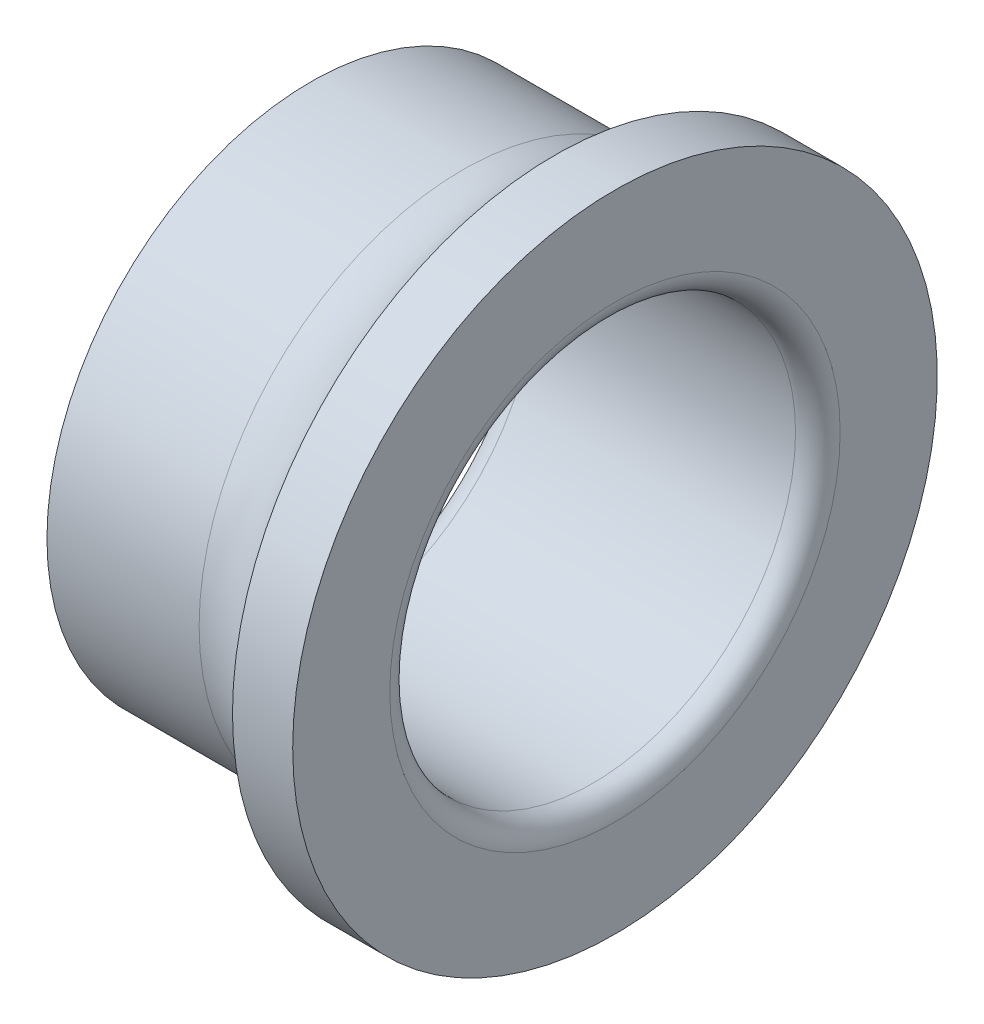
ISO-10303-21;
HEADER;
FILE_DESCRIPTION(('STEP AP214'),'2;1');
FILE_NAME('part.step','',(''),(''),'','','');
FILE_SCHEMA(('AUTOMOTIVE_DESIGN { 1 0 10303 214 1 1 1 1 }'));
ENDSEC;
DATA;
#1=APPLICATION_CONTEXT('core data for automotive mechanical design processes');
#2=APPLICATION_PROTOCOL_DEFINITION('international standard','automotive_design',2000,#1);
#3=PRODUCT_CONTEXT('',#1,'mechanical');
#4=PRODUCT('Part','Part','',(#3));
#5=PRODUCT_RELATED_PRODUCT_CATEGORY('part','',(#4));
#6=PRODUCT_DEFINITION_FORMATION('','',#4);
#7=PRODUCT_DEFINITION_CONTEXT('part definition',#1,'design');
#8=PRODUCT_DEFINITION('design','',#6,#7);
#9=PRODUCT_DEFINITION_SHAPE('','',#8);
#10=(LENGTH_UNIT() NAMED_UNIT(*) SI_UNIT(.MILLI.,.METRE.));
#11=(NAMED_UNIT(*) PLANE_ANGLE_UNIT() SI_UNIT($,.RADIAN.));
#12=(NAMED_UNIT(*) SI_UNIT($,.STERADIAN.) SOLID_ANGLE_UNIT());
#13=UNCERTAINTY_MEASURE_WITH_UNIT(LENGTH_MEASURE(1.E-05),#10,'distance_accuracy_value','');
#14=(GEOMETRIC_REPRESENTATION_CONTEXT(3) GLOBAL_UNCERTAINTY_ASSIGNED_CONTEXT((#13)) GLOBAL_UNIT_ASSIGNED_CONTEXT((#10,
#11,#12)) REPRESENTATION_CONTEXT('',''));
#15=CARTESIAN_POINT('',(0.,0.,0.));
#16=DIRECTION('',(0.,0.,1.));
#17=DIRECTION('',(1.,0.,0.));
#18=AXIS2_PLACEMENT_3D('',#15,#16,#17);
#19=CARTESIAN_POINT('',(13.9,0.,0.));
#20=DIRECTION('',(-1.,0.,0.));
#21=DIRECTION('',(0.,0.,1.));
#22=AXIS2_PLACEMENT_3D('',#19,#20,#21);
#23=TOROIDAL_SURFACE('',#22,11.1,1.1);
#24=CARTESIAN_POINT('',(15.,0.,0.));
#25=DIRECTION('',(-1.,0.,0.));
#26=DIRECTION('',(0.,0.,1.));
#27=AXIS2_PLACEMENT_3D('',#24,#25,#26);
#28=CIRCLE('',#27,11.1);
#29=CARTESIAN_POINT('',(15.,0.,11.1));
#30=VERTEX_POINT('',#29);
#31=EDGE_CURVE('E10',#30,#30,#28,.T.);
#32=ORIENTED_EDGE('',*,*,#31,.F.);
#33=EDGE_LOOP('',(#32));
#34=FACE_BOUND('',#33,.T.);
#35=CARTESIAN_POINT('',(13.9,0.,0.));
#36=DIRECTION('',(-1.,0.,0.));
#37=DIRECTION('',(0.,0.,1.));
#38=AXIS2_PLACEMENT_3D('',#35,#36,#37);
#39=CIRCLE('',#38,10.);
#40=CARTESIAN_POINT('',(13.9,0.,10.));
#41=VERTEX_POINT('',#40);
#42=EDGE_CURVE('E56',#41,#41,#39,.T.);
#43=ORIENTED_EDGE('',*,*,#42,.T.);
#44=EDGE_LOOP('',(#43));
#45=FACE_BOUND('',#44,.T.);
#46=ADVANCED_FACE('F14',(#34,#45),#23,.T.);
#47=CARTESIAN_POINT('',(15.,11.1,0.));
#48=DIRECTION('',(-1.,0.,0.));
#49=DIRECTION('',(0.,0.,1.));
#50=AXIS2_PLACEMENT_3D('',#47,#48,#49);
#51=PLANE('',#50);
#52=CARTESIAN_POINT('',(15.,0.,0.));
#53=DIRECTION('',(-1.,0.,0.));
#54=DIRECTION('',(0.,0.,1.));
#55=AXIS2_PLACEMENT_3D('',#52,#53,#54);
#56=CIRCLE('',#55,15.8869086912965);
#57=CARTESIAN_POINT('',(15.,0.,15.8869086912965));
#58=VERTEX_POINT('',#57);
#59=EDGE_CURVE('E21',#58,#58,#56,.T.);
#60=ORIENTED_EDGE('',*,*,#59,.F.);
#61=EDGE_LOOP('',(#60));
#62=FACE_BOUND('',#61,.T.);
#63=ORIENTED_EDGE('',*,*,#31,.T.);
#64=EDGE_LOOP('',(#63));
#65=FACE_BOUND('',#64,.T.);
#66=ADVANCED_FACE('F95',(#62,#65),#51,.F.);
#67=CARTESIAN_POINT('',(13.9,0.,0.));
#68=DIRECTION('',(-1.,0.,0.));
#69=DIRECTION('',(0.,0.,1.));
#70=AXIS2_PLACEMENT_3D('',#67,#68,#69);
#71=CYLINDRICAL_SURFACE('',#70,15.8869086912965);
#72=CARTESIAN_POINT('',(12.0315389351832,0.,0.));
#73=DIRECTION('',(-1.,0.,0.));
#74=DIRECTION('',(0.,0.,1.));
#75=AXIS2_PLACEMENT_3D('',#72,#73,#74);
#76=CIRCLE('',#75,15.8869086912965);
#77=CARTESIAN_POINT('',(12.0315389351832,0.,15.8869086912965));
#78=VERTEX_POINT('',#77);
#79=EDGE_CURVE('E30',#78,#78,#76,.T.);
#80=ORIENTED_EDGE('',*,*,#79,.F.);
#81=EDGE_LOOP('',(#80));
#82=FACE_BOUND('',#81,.T.);
#83=ORIENTED_EDGE('',*,*,#59,.T.);
#84=EDGE_LOOP('',(#83));
#85=FACE_BOUND('',#84,.T.);
#86=ADVANCED_FACE('F88',(#82,#85),#71,.T.);
#87=CARTESIAN_POINT('',(7.5,0.,0.));
#88=DIRECTION('',(-1.,0.,0.));
#89=DIRECTION('',(0.,0.,1.));
#90=AXIS2_PLACEMENT_3D('',#87,#88,#89);
#91=TOROIDAL_SURFACE('',#90,18.,5.);
#92=ORIENTED_EDGE('',*,*,#79,.T.);
#93=EDGE_LOOP('',(#92));
#94=FACE_BOUND('',#93,.T.);
#95=CARTESIAN_POINT('',(7.5,0.,0.));
#96=DIRECTION('',(-1.,0.,0.));
#97=DIRECTION('',(0.,0.,1.));
#98=AXIS2_PLACEMENT_3D('',#95,#96,#97);
#99=CIRCLE('',#98,13.);
#100=CARTESIAN_POINT('',(7.5,0.,13.));
#101=VERTEX_POINT('',#100);
#102=EDGE_CURVE('E38',#101,#101,#99,.T.);
#103=ORIENTED_EDGE('',*,*,#102,.F.);
#104=EDGE_LOOP('',(#103));
#105=FACE_BOUND('',#104,.T.);
#106=ADVANCED_FACE('F83',(#94,#105),#91,.F.);
#107=CARTESIAN_POINT('',(13.9,0.,0.));
#108=DIRECTION('',(-1.,0.,0.));
#109=DIRECTION('',(0.,0.,1.));
#110=AXIS2_PLACEMENT_3D('',#107,#108,#109);
#111=CYLINDRICAL_SURFACE('',#110,13.);
#112=CARTESIAN_POINT('',(0.,0.,0.));
#113=DIRECTION('',(-1.,0.,0.));
#114=DIRECTION('',(0.,0.,1.));
#115=AXIS2_PLACEMENT_3D('',#112,#113,#114);
#116=CIRCLE('',#115,13.);
#117=CARTESIAN_POINT('',(0.,0.,13.));
#118=VERTEX_POINT('',#117);
#119=EDGE_CURVE('E44',#118,#118,#116,.T.);
#120=ORIENTED_EDGE('',*,*,#119,.F.);
#121=EDGE_LOOP('',(#120));
#122=FACE_BOUND('',#121,.T.);
#123=ORIENTED_EDGE('',*,*,#102,.T.);
#124=EDGE_LOOP('',(#123));
#125=FACE_BOUND('',#124,.T.);
#126=ADVANCED_FACE('F77',(#122,#125),#111,.T.);
#127=CARTESIAN_POINT('',(0.,13.,0.));
#128=DIRECTION('',(1.,0.,0.));
#129=DIRECTION('',(0.,0.,-1.));
#130=AXIS2_PLACEMENT_3D('',#127,#128,#129);
#131=PLANE('',#130);
#132=CARTESIAN_POINT('',(0.,0.,0.));
#133=DIRECTION('',(-1.,0.,0.));
#134=DIRECTION('',(0.,0.,1.));
#135=AXIS2_PLACEMENT_3D('',#132,#133,#134);
#136=CIRCLE('',#135,11.1);
#137=CARTESIAN_POINT('',(0.,0.,11.1));
#138=VERTEX_POINT('',#137);
#139=EDGE_CURVE('E48',#138,#138,#136,.T.);
#140=ORIENTED_EDGE('',*,*,#139,.F.);
#141=EDGE_LOOP('',(#140));
#142=FACE_BOUND('',#141,.T.);
#143=ORIENTED_EDGE('',*,*,#119,.T.);
#144=EDGE_LOOP('',(#143));
#145=FACE_BOUND('',#144,.T.);
#146=ADVANCED_FACE('F71',(#142,#145),#131,.F.);
#147=CARTESIAN_POINT('',(1.1,0.,0.));
#148=DIRECTION('',(-1.,0.,0.));
#149=DIRECTION('',(0.,0.,1.));
#150=AXIS2_PLACEMENT_3D('',#147,#148,#149);
#151=TOROIDAL_SURFACE('',#150,11.1,1.1);
#152=CARTESIAN_POINT('',(1.1,0.,0.));
#153=DIRECTION('',(-1.,0.,0.));
#154=DIRECTION('',(0.,0.,1.));
#155=AXIS2_PLACEMENT_3D('',#152,#153,#154);
#156=CIRCLE('',#155,10.);
#157=CARTESIAN_POINT('',(1.1,0.,10.));
#158=VERTEX_POINT('',#157);
#159=EDGE_CURVE('E52',#158,#158,#156,.T.);
#160=ORIENTED_EDGE('',*,*,#159,.F.);
#161=EDGE_LOOP('',(#160));
#162=FACE_BOUND('',#161,.T.);
#163=ORIENTED_EDGE('',*,*,#139,.T.);
#164=EDGE_LOOP('',(#163));
#165=FACE_BOUND('',#164,.T.);
#166=ADVANCED_FACE('F65',(#162,#165),#151,.T.);
#167=CARTESIAN_POINT('',(13.9,0.,0.));
#168=DIRECTION('',(-1.,0.,0.));
#169=DIRECTION('',(0.,0.,1.));
#170=AXIS2_PLACEMENT_3D('',#167,#168,#169);
#171=CYLINDRICAL_SURFACE('',#170,10.);
#172=ORIENTED_EDGE('',*,*,#42,.F.);
#173=EDGE_LOOP('',(#172));
#174=FACE_BOUND('',#173,.T.);
#175=ORIENTED_EDGE('',*,*,#159,.T.);
#176=EDGE_LOOP('',(#175));
#177=FACE_BOUND('',#176,.T.);
#178=ADVANCED_FACE('F62',(#174,#177),#171,.F.);
#179=CLOSED_SHELL('',(#46,#66,#86,#106,#126,#146,#166,#178));
#180=MANIFOLD_SOLID_BREP('B1',#179);
#181=ADVANCED_BREP_SHAPE_REPRESENTATION('',(#18,#180),#14);
#182=SHAPE_DEFINITION_REPRESENTATION(#9,#181);
ENDSEC;
END-ISO-10303-21;
